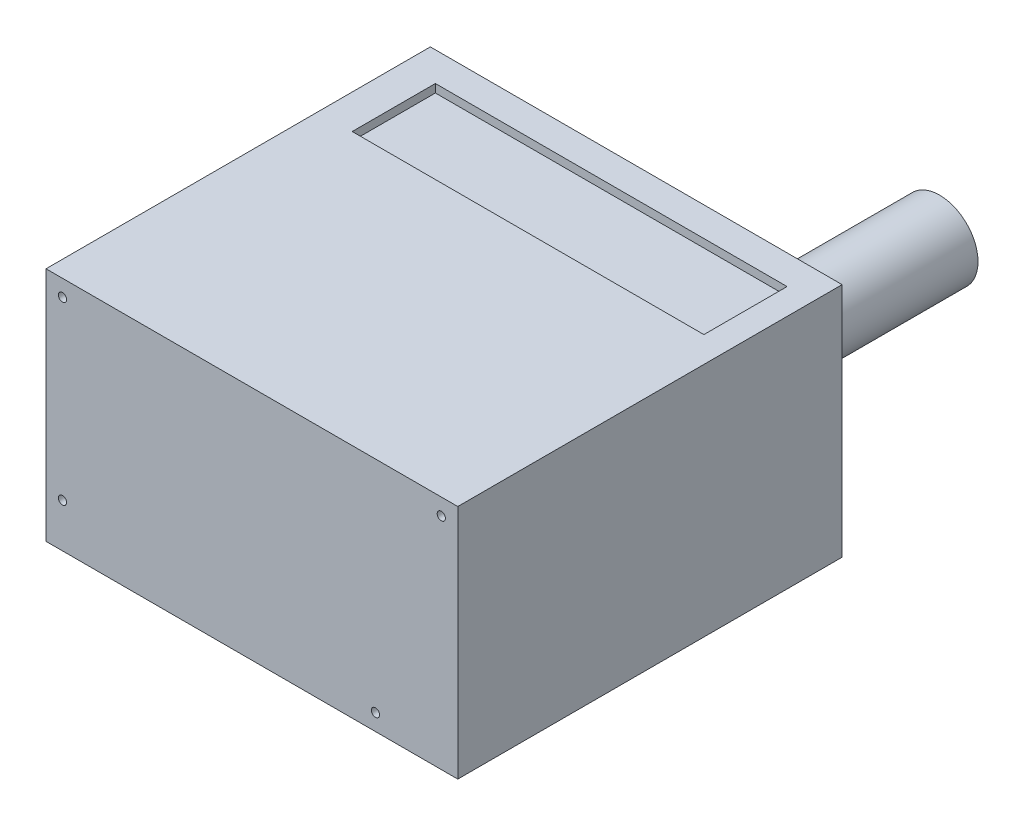
ISO-10303-21;
HEADER;
FILE_DESCRIPTION(('STEP AP214'),'2;1');
FILE_NAME('part.step','',(''),(''),'','','');
FILE_SCHEMA(('AUTOMOTIVE_DESIGN { 1 0 10303 214 1 1 1 1 }'));
ENDSEC;
DATA;
#1=APPLICATION_CONTEXT('core data for automotive mechanical design processes');
#2=APPLICATION_PROTOCOL_DEFINITION('international standard','automotive_design',2000,#1);
#3=PRODUCT_CONTEXT('',#1,'mechanical');
#4=PRODUCT('Part','Part','',(#3));
#5=PRODUCT_RELATED_PRODUCT_CATEGORY('part','',(#4));
#6=PRODUCT_DEFINITION_FORMATION('','',#4);
#7=PRODUCT_DEFINITION_CONTEXT('part definition',#1,'design');
#8=PRODUCT_DEFINITION('design','',#6,#7);
#9=PRODUCT_DEFINITION_SHAPE('','',#8);
#10=(LENGTH_UNIT() NAMED_UNIT(*) SI_UNIT(.MILLI.,.METRE.));
#11=(NAMED_UNIT(*) PLANE_ANGLE_UNIT() SI_UNIT($,.RADIAN.));
#12=(NAMED_UNIT(*) SI_UNIT($,.STERADIAN.) SOLID_ANGLE_UNIT());
#13=UNCERTAINTY_MEASURE_WITH_UNIT(LENGTH_MEASURE(1.E-05),#10,'distance_accuracy_value','');
#14=(GEOMETRIC_REPRESENTATION_CONTEXT(3) GLOBAL_UNCERTAINTY_ASSIGNED_CONTEXT((#13)) GLOBAL_UNIT_ASSIGNED_CONTEXT((#10,
#11,#12)) REPRESENTATION_CONTEXT('',''));
#15=CARTESIAN_POINT('',(0.,0.,0.));
#16=DIRECTION('',(0.,0.,1.));
#17=DIRECTION('',(1.,0.,0.));
#18=AXIS2_PLACEMENT_3D('',#15,#16,#17);
#19=CARTESIAN_POINT('',(0.,86.,0.));
#20=DIRECTION('',(1.,0.,0.));
#21=DIRECTION('',(0.,0.,-1.));
#22=AXIS2_PLACEMENT_3D('',#19,#20,#21);
#23=PLANE('',#22);
#24=DIRECTION('',(0.,0.,1.));
#25=VECTOR('',#24,1.);
#26=CARTESIAN_POINT('',(0.,0.,0.));
#27=LINE('',#26,#25);
#28=CARTESIAN_POINT('',(0.,0.,-140.));
#29=VERTEX_POINT('',#28);
#30=CARTESIAN_POINT('',(0.,0.,0.));
#31=VERTEX_POINT('',#30);
#32=EDGE_CURVE('E265',#29,#31,#27,.T.);
#33=ORIENTED_EDGE('',*,*,#32,.T.);
#34=DIRECTION('',(0.,-1.,0.));
#35=VECTOR('',#34,1.);
#36=CARTESIAN_POINT('',(0.,86.,0.));
#37=LINE('',#36,#35);
#38=CARTESIAN_POINT('',(0.,86.,0.));
#39=VERTEX_POINT('',#38);
#40=EDGE_CURVE('E59',#39,#31,#37,.T.);
#41=ORIENTED_EDGE('',*,*,#40,.F.);
#42=DIRECTION('',(0.,0.,1.));
#43=VECTOR('',#42,1.);
#44=CARTESIAN_POINT('',(0.,86.,0.));
#45=LINE('',#44,#43);
#46=CARTESIAN_POINT('',(0.,86.,-140.));
#47=VERTEX_POINT('',#46);
#48=EDGE_CURVE('E269',#47,#39,#45,.T.);
#49=ORIENTED_EDGE('',*,*,#48,.F.);
#50=DIRECTION('',(0.,-1.,0.));
#51=VECTOR('',#50,1.);
#52=CARTESIAN_POINT('',(0.,86.,-140.));
#53=LINE('',#52,#51);
#54=EDGE_CURVE('E283',#47,#29,#53,.T.);
#55=ORIENTED_EDGE('',*,*,#54,.T.);
#56=EDGE_LOOP('',(#33,#41,#49,#55));
#57=FACE_BOUND('',#56,.T.);
#58=ADVANCED_FACE('F51',(#57),#23,.F.);
#59=CARTESIAN_POINT('',(0.,86.,0.));
#60=DIRECTION('',(0.,0.,-1.));
#61=DIRECTION('',(-1.,0.,0.));
#62=AXIS2_PLACEMENT_3D('',#59,#60,#61);
#63=PLANE('',#62);
#64=CARTESIAN_POINT('',(144.,80.,0.));
#65=DIRECTION('',(0.,0.,1.));
#66=DIRECTION('',(1.,0.,0.));
#67=AXIS2_PLACEMENT_3D('',#64,#65,#66);
#68=CIRCLE('',#67,1.5);
#69=CARTESIAN_POINT('',(145.5,80.,0.));
#70=VERTEX_POINT('',#69);
#71=EDGE_CURVE('E254',#70,#70,#68,.T.);
#72=ORIENTED_EDGE('',*,*,#71,.F.);
#73=EDGE_LOOP('',(#72));
#74=FACE_BOUND('',#73,.T.);
#75=CARTESIAN_POINT('',(120.,6.,0.));
#76=DIRECTION('',(0.,0.,1.));
#77=DIRECTION('',(1.,0.,0.));
#78=AXIS2_PLACEMENT_3D('',#75,#76,#77);
#79=CIRCLE('',#78,1.5);
#80=CARTESIAN_POINT('',(121.5,6.,0.));
#81=VERTEX_POINT('',#80);
#82=EDGE_CURVE('E246',#81,#81,#79,.T.);
#83=ORIENTED_EDGE('',*,*,#82,.F.);
#84=EDGE_LOOP('',(#83));
#85=FACE_BOUND('',#84,.T.);
#86=CARTESIAN_POINT('',(6.,16.,0.));
#87=DIRECTION('',(0.,0.,1.));
#88=DIRECTION('',(1.,0.,0.));
#89=AXIS2_PLACEMENT_3D('',#86,#87,#88);
#90=CIRCLE('',#89,1.5);
#91=CARTESIAN_POINT('',(7.5,16.,0.));
#92=VERTEX_POINT('',#91);
#93=EDGE_CURVE('E237',#92,#92,#90,.T.);
#94=ORIENTED_EDGE('',*,*,#93,.F.);
#95=EDGE_LOOP('',(#94));
#96=FACE_BOUND('',#95,.T.);
#97=CARTESIAN_POINT('',(6.,80.,0.));
#98=DIRECTION('',(0.,0.,1.));
#99=DIRECTION('',(1.,0.,0.));
#100=AXIS2_PLACEMENT_3D('',#97,#98,#99);
#101=CIRCLE('',#100,1.5);
#102=CARTESIAN_POINT('',(7.5,80.,0.));
#103=VERTEX_POINT('',#102);
#104=EDGE_CURVE('E241',#103,#103,#101,.T.);
#105=ORIENTED_EDGE('',*,*,#104,.F.);
#106=EDGE_LOOP('',(#105));
#107=FACE_BOUND('',#106,.T.);
#108=DIRECTION('',(1.,0.,0.));
#109=VECTOR('',#108,1.);
#110=CARTESIAN_POINT('',(0.,0.,0.));
#111=LINE('',#110,#109);
#112=CARTESIAN_POINT('',(150.,0.,0.));
#113=VERTEX_POINT('',#112);
#114=EDGE_CURVE('E287',#31,#113,#111,.T.);
#115=ORIENTED_EDGE('',*,*,#114,.T.);
#116=DIRECTION('',(0.,-1.,0.));
#117=VECTOR('',#116,1.);
#118=CARTESIAN_POINT('',(150.,86.,0.));
#119=LINE('',#118,#117);
#120=CARTESIAN_POINT('',(150.,86.,0.));
#121=VERTEX_POINT('',#120);
#122=EDGE_CURVE('E302',#121,#113,#119,.T.);
#123=ORIENTED_EDGE('',*,*,#122,.F.);
#124=DIRECTION('',(1.,0.,0.));
#125=VECTOR('',#124,1.);
#126=CARTESIAN_POINT('',(0.,86.,0.));
#127=LINE('',#126,#125);
#128=EDGE_CURVE('E273',#39,#121,#127,.T.);
#129=ORIENTED_EDGE('',*,*,#128,.F.);
#130=ORIENTED_EDGE('',*,*,#40,.T.);
#131=EDGE_LOOP('',(#115,#123,#129,#130));
#132=FACE_BOUND('',#131,.T.);
#133=ADVANCED_FACE('F309',(#74,#85,#96,#107,#132),#63,.F.);
#134=CARTESIAN_POINT('',(150.,86.,0.));
#135=DIRECTION('',(-1.,0.,0.));
#136=DIRECTION('',(0.,0.,1.));
#137=AXIS2_PLACEMENT_3D('',#134,#135,#136);
#138=PLANE('',#137);
#139=DIRECTION('',(0.,0.,-1.));
#140=VECTOR('',#139,1.);
#141=CARTESIAN_POINT('',(150.,0.,0.));
#142=LINE('',#141,#140);
#143=CARTESIAN_POINT('',(150.,0.,-140.));
#144=VERTEX_POINT('',#143);
#145=EDGE_CURVE('E290',#113,#144,#142,.T.);
#146=ORIENTED_EDGE('',*,*,#145,.T.);
#147=DIRECTION('',(0.,-1.,0.));
#148=VECTOR('',#147,1.);
#149=CARTESIAN_POINT('',(150.,86.,-140.));
#150=LINE('',#149,#148);
#151=CARTESIAN_POINT('',(150.,86.,-140.));
#152=VERTEX_POINT('',#151);
#153=EDGE_CURVE('E298',#152,#144,#150,.T.);
#154=ORIENTED_EDGE('',*,*,#153,.F.);
#155=DIRECTION('',(0.,0.,-1.));
#156=VECTOR('',#155,1.);
#157=CARTESIAN_POINT('',(150.,86.,0.));
#158=LINE('',#157,#156);
#159=EDGE_CURVE('E277',#121,#152,#158,.T.);
#160=ORIENTED_EDGE('',*,*,#159,.F.);
#161=ORIENTED_EDGE('',*,*,#122,.T.);
#162=EDGE_LOOP('',(#146,#154,#160,#161));
#163=FACE_BOUND('',#162,.T.);
#164=ADVANCED_FACE('F321',(#163),#138,.F.);
#165=CARTESIAN_POINT('',(0.,86.,-140.));
#166=DIRECTION('',(0.,0.,1.));
#167=DIRECTION('',(1.,0.,0.));
#168=AXIS2_PLACEMENT_3D('',#165,#166,#167);
#169=PLANE('',#168);
#170=DIRECTION('',(1.,0.,0.));
#171=VECTOR('',#170,1.);
#172=CARTESIAN_POINT('',(15.74974103616,77.9100774654822,-140.));
#173=LINE('',#172,#171);
#174=CARTESIAN_POINT('',(15.74974103616,77.9100774654822,-140.));
#175=VERTEX_POINT('',#174);
#176=CARTESIAN_POINT('',(114.609488339326,77.9100774654822,-140.));
#177=VERTEX_POINT('',#176);
#178=EDGE_CURVE('E176',#175,#177,#173,.T.);
#179=ORIENTED_EDGE('',*,*,#178,.F.);
#180=DIRECTION('',(0.,1.,0.));
#181=VECTOR('',#180,1.);
#182=CARTESIAN_POINT('',(15.74974103616,77.9100774654822,-140.));
#183=LINE('',#182,#181);
#184=CARTESIAN_POINT('',(15.74974103616,5.90029547932147,-140.));
#185=VERTEX_POINT('',#184);
#186=EDGE_CURVE('E66',#185,#175,#183,.T.);
#187=ORIENTED_EDGE('',*,*,#186,.F.);
#188=DIRECTION('',(-1.,0.,0.));
#189=VECTOR('',#188,1.);
#190=CARTESIAN_POINT('',(15.74974103616,5.90029547932147,-140.));
#191=LINE('',#190,#189);
#192=CARTESIAN_POINT('',(114.609488339326,5.90029547932147,-140.));
#193=VERTEX_POINT('',#192);
#194=EDGE_CURVE('E163',#193,#185,#191,.T.);
#195=ORIENTED_EDGE('',*,*,#194,.F.);
#196=DIRECTION('',(0.,-1.,0.));
#197=VECTOR('',#196,1.);
#198=CARTESIAN_POINT('',(114.609488339326,77.9100774654822,-140.));
#199=LINE('',#198,#197);
#200=EDGE_CURVE('E167',#177,#193,#199,.T.);
#201=ORIENTED_EDGE('',*,*,#200,.F.);
#202=EDGE_LOOP('',(#179,#187,#195,#201));
#203=FACE_BOUND('',#202,.T.);
#204=CARTESIAN_POINT('',(133.5,66.,-140.));
#205=DIRECTION('',(0.,0.,1.));
#206=DIRECTION('',(1.,0.,0.));
#207=AXIS2_PLACEMENT_3D('',#204,#205,#206);
#208=CIRCLE('',#207,14.);
#209=CARTESIAN_POINT('',(147.5,66.,-140.));
#210=VERTEX_POINT('',#209);
#211=EDGE_CURVE('E11',#210,#210,#208,.F.);
#212=ORIENTED_EDGE('',*,*,#211,.F.);
#213=EDGE_LOOP('',(#212));
#214=FACE_BOUND('',#213,.T.);
#215=DIRECTION('',(-1.,0.,0.));
#216=VECTOR('',#215,1.);
#217=CARTESIAN_POINT('',(0.,0.,-140.));
#218=LINE('',#217,#216);
#219=EDGE_CURVE('E274',#144,#29,#218,.T.);
#220=ORIENTED_EDGE('',*,*,#219,.T.);
#221=ORIENTED_EDGE('',*,*,#54,.F.);
#222=DIRECTION('',(-1.,0.,0.));
#223=VECTOR('',#222,1.);
#224=CARTESIAN_POINT('',(0.,86.,-140.));
#225=LINE('',#224,#223);
#226=EDGE_CURVE('E280',#152,#47,#225,.T.);
#227=ORIENTED_EDGE('',*,*,#226,.F.);
#228=ORIENTED_EDGE('',*,*,#153,.T.);
#229=EDGE_LOOP('',(#220,#221,#227,#228));
#230=FACE_BOUND('',#229,.T.);
#231=ADVANCED_FACE('F325',(#203,#214,#230),#169,.F.);
#232=CARTESIAN_POINT('',(0.,86.,0.));
#233=DIRECTION('',(0.,-1.,0.));
#234=DIRECTION('',(0.,0.,-1.));
#235=AXIS2_PLACEMENT_3D('',#232,#233,#234);
#236=PLANE('',#235);
#237=DIRECTION('',(1.,0.,0.));
#238=VECTOR('',#237,1.);
#239=CARTESIAN_POINT('',(12.4736522115443,86.,-99.0671024841363));
#240=LINE('',#239,#238);
#241=CARTESIAN_POINT('',(12.4736522115443,86.,-99.0671024841363));
#242=VERTEX_POINT('',#241);
#243=CARTESIAN_POINT('',(140.586042786786,86.,-99.0671024841363));
#244=VERTEX_POINT('',#243);
#245=EDGE_CURVE('E214',#242,#244,#240,.T.);
#246=ORIENTED_EDGE('',*,*,#245,.F.);
#247=DIRECTION('',(0.,0.,1.));
#248=VECTOR('',#247,1.);
#249=CARTESIAN_POINT('',(12.4736522115443,86.,-129.36795295147));
#250=LINE('',#249,#248);
#251=CARTESIAN_POINT('',(12.4736522115443,86.,-129.36795295147));
#252=VERTEX_POINT('',#251);
#253=EDGE_CURVE('E74',#252,#242,#250,.T.);
#254=ORIENTED_EDGE('',*,*,#253,.F.);
#255=DIRECTION('',(-1.,0.,0.));
#256=VECTOR('',#255,1.);
#257=CARTESIAN_POINT('',(12.4736522115443,86.,-129.36795295147));
#258=LINE('',#257,#256);
#259=CARTESIAN_POINT('',(140.586042786786,86.,-129.36795295147));
#260=VERTEX_POINT('',#259);
#261=EDGE_CURVE('E199',#260,#252,#258,.T.);
#262=ORIENTED_EDGE('',*,*,#261,.F.);
#263=DIRECTION('',(0.,0.,-1.));
#264=VECTOR('',#263,1.);
#265=CARTESIAN_POINT('',(140.586042786786,86.,-129.36795295147));
#266=LINE('',#265,#264);
#267=EDGE_CURVE('E218',#244,#260,#266,.T.);
#268=ORIENTED_EDGE('',*,*,#267,.F.);
#269=EDGE_LOOP('',(#246,#254,#262,#268));
#270=FACE_BOUND('',#269,.T.);
#271=ORIENTED_EDGE('',*,*,#48,.T.);
#272=ORIENTED_EDGE('',*,*,#128,.T.);
#273=ORIENTED_EDGE('',*,*,#159,.T.);
#274=ORIENTED_EDGE('',*,*,#226,.T.);
#275=EDGE_LOOP('',(#271,#272,#273,#274));
#276=FACE_BOUND('',#275,.T.);
#277=ADVANCED_FACE('F327',(#270,#276),#236,.F.);
#278=CARTESIAN_POINT('',(0.,0.,0.));
#279=DIRECTION('',(0.,-1.,0.));
#280=DIRECTION('',(0.,0.,-1.));
#281=AXIS2_PLACEMENT_3D('',#278,#279,#280);
#282=PLANE('',#281);
#283=ORIENTED_EDGE('',*,*,#32,.F.);
#284=ORIENTED_EDGE('',*,*,#219,.F.);
#285=ORIENTED_EDGE('',*,*,#145,.F.);
#286=ORIENTED_EDGE('',*,*,#114,.F.);
#287=EDGE_LOOP('',(#283,#284,#285,#286));
#288=FACE_BOUND('',#287,.T.);
#289=ADVANCED_FACE('F317',(#288),#282,.T.);
#290=CARTESIAN_POINT('',(6.,80.,-2.99999999999994));
#291=DIRECTION('',(0.,0.,1.));
#292=DIRECTION('',(1.,0.,0.));
#293=AXIS2_PLACEMENT_3D('',#290,#291,#292);
#294=CYLINDRICAL_SURFACE('',#293,1.5);
#295=CARTESIAN_POINT('',(6.,80.,-2.99999999999994));
#296=DIRECTION('',(0.,0.,1.));
#297=DIRECTION('',(1.,0.,0.));
#298=AXIS2_PLACEMENT_3D('',#295,#296,#297);
#299=CIRCLE('',#298,1.5);
#300=CARTESIAN_POINT('',(7.5,80.,-2.99999999999994));
#301=VERTEX_POINT('',#300);
#302=EDGE_CURVE('E261',#301,#301,#299,.T.);
#303=ORIENTED_EDGE('',*,*,#302,.F.);
#304=EDGE_LOOP('',(#303));
#305=FACE_BOUND('',#304,.T.);
#306=ORIENTED_EDGE('',*,*,#104,.T.);
#307=EDGE_LOOP('',(#306));
#308=FACE_BOUND('',#307,.T.);
#309=ADVANCED_FACE('F335',(#305,#308),#294,.F.);
#310=CARTESIAN_POINT('',(6.,80.,-2.99999999999994));
#311=DIRECTION('',(0.,0.,1.));
#312=DIRECTION('',(1.,0.,0.));
#313=AXIS2_PLACEMENT_3D('',#310,#311,#312);
#314=PLANE('',#313);
#315=ORIENTED_EDGE('',*,*,#302,.T.);
#316=EDGE_LOOP('',(#315));
#317=FACE_BOUND('',#316,.T.);
#318=ADVANCED_FACE('F359',(#317),#314,.T.);
#319=CARTESIAN_POINT('',(6.,16.,-2.99999999999994));
#320=DIRECTION('',(0.,0.,1.));
#321=DIRECTION('',(1.,0.,0.));
#322=AXIS2_PLACEMENT_3D('',#319,#320,#321);
#323=CYLINDRICAL_SURFACE('',#322,1.5);
#324=CARTESIAN_POINT('',(6.,16.,-2.99999999999994));
#325=DIRECTION('',(0.,0.,1.));
#326=DIRECTION('',(1.,0.,0.));
#327=AXIS2_PLACEMENT_3D('',#324,#325,#326);
#328=CIRCLE('',#327,1.5);
#329=CARTESIAN_POINT('',(7.5,16.,-2.99999999999994));
#330=VERTEX_POINT('',#329);
#331=EDGE_CURVE('E242',#330,#330,#328,.T.);
#332=ORIENTED_EDGE('',*,*,#331,.F.);
#333=EDGE_LOOP('',(#332));
#334=FACE_BOUND('',#333,.T.);
#335=ORIENTED_EDGE('',*,*,#93,.T.);
#336=EDGE_LOOP('',(#335));
#337=FACE_BOUND('',#336,.T.);
#338=ADVANCED_FACE('F365',(#334,#337),#323,.F.);
#339=CARTESIAN_POINT('',(6.,16.,-2.99999999999994));
#340=DIRECTION('',(0.,0.,1.));
#341=DIRECTION('',(1.,0.,0.));
#342=AXIS2_PLACEMENT_3D('',#339,#340,#341);
#343=PLANE('',#342);
#344=ORIENTED_EDGE('',*,*,#331,.T.);
#345=EDGE_LOOP('',(#344));
#346=FACE_BOUND('',#345,.T.);
#347=ADVANCED_FACE('F386',(#346),#343,.T.);
#348=CARTESIAN_POINT('',(120.,6.,-2.99999999999994));
#349=DIRECTION('',(0.,0.,1.));
#350=DIRECTION('',(1.,0.,0.));
#351=AXIS2_PLACEMENT_3D('',#348,#349,#350);
#352=CYLINDRICAL_SURFACE('',#351,1.5);
#353=CARTESIAN_POINT('',(120.,6.,-2.99999999999994));
#354=DIRECTION('',(0.,0.,1.));
#355=DIRECTION('',(1.,0.,0.));
#356=AXIS2_PLACEMENT_3D('',#353,#354,#355);
#357=CIRCLE('',#356,1.5);
#358=CARTESIAN_POINT('',(121.5,6.,-2.99999999999994));
#359=VERTEX_POINT('',#358);
#360=EDGE_CURVE('E250',#359,#359,#357,.T.);
#361=ORIENTED_EDGE('',*,*,#360,.F.);
#362=EDGE_LOOP('',(#361));
#363=FACE_BOUND('',#362,.T.);
#364=ORIENTED_EDGE('',*,*,#82,.T.);
#365=EDGE_LOOP('',(#364));
#366=FACE_BOUND('',#365,.T.);
#367=ADVANCED_FACE('F382',(#363,#366),#352,.F.);
#368=CARTESIAN_POINT('',(120.,6.,-2.99999999999994));
#369=DIRECTION('',(0.,0.,1.));
#370=DIRECTION('',(1.,0.,0.));
#371=AXIS2_PLACEMENT_3D('',#368,#369,#370);
#372=PLANE('',#371);
#373=ORIENTED_EDGE('',*,*,#360,.T.);
#374=EDGE_LOOP('',(#373));
#375=FACE_BOUND('',#374,.T.);
#376=ADVANCED_FACE('F378',(#375),#372,.T.);
#377=CARTESIAN_POINT('',(144.,80.,-2.99999999999994));
#378=DIRECTION('',(0.,0.,1.));
#379=DIRECTION('',(1.,0.,0.));
#380=AXIS2_PLACEMENT_3D('',#377,#378,#379);
#381=CYLINDRICAL_SURFACE('',#380,1.5);
#382=CARTESIAN_POINT('',(144.,80.,-2.99999999999994));
#383=DIRECTION('',(0.,0.,1.));
#384=DIRECTION('',(1.,0.,0.));
#385=AXIS2_PLACEMENT_3D('',#382,#383,#384);
#386=CIRCLE('',#385,1.5);
#387=CARTESIAN_POINT('',(145.5,80.,-2.99999999999994));
#388=VERTEX_POINT('',#387);
#389=EDGE_CURVE('E228',#388,#388,#386,.T.);
#390=ORIENTED_EDGE('',*,*,#389,.F.);
#391=EDGE_LOOP('',(#390));
#392=FACE_BOUND('',#391,.T.);
#393=ORIENTED_EDGE('',*,*,#71,.T.);
#394=EDGE_LOOP('',(#393));
#395=FACE_BOUND('',#394,.T.);
#396=ADVANCED_FACE('F374',(#392,#395),#381,.F.);
#397=CARTESIAN_POINT('',(144.,80.,-2.99999999999994));
#398=DIRECTION('',(0.,0.,1.));
#399=DIRECTION('',(1.,0.,0.));
#400=AXIS2_PLACEMENT_3D('',#397,#398,#399);
#401=PLANE('',#400);
#402=ORIENTED_EDGE('',*,*,#389,.T.);
#403=EDGE_LOOP('',(#402));
#404=FACE_BOUND('',#403,.T.);
#405=ADVANCED_FACE('F370',(#404),#401,.T.);
#406=CARTESIAN_POINT('',(12.4736522115443,83.,-129.36795295147));
#407=DIRECTION('',(-1.,0.,0.));
#408=DIRECTION('',(0.,0.,1.));
#409=AXIS2_PLACEMENT_3D('',#406,#407,#408);
#410=PLANE('',#409);
#411=ORIENTED_EDGE('',*,*,#253,.T.);
#412=DIRECTION('',(0.,1.,0.));
#413=VECTOR('',#412,1.);
#414=CARTESIAN_POINT('',(12.4736522115443,83.,-99.0671024841363));
#415=LINE('',#414,#413);
#416=CARTESIAN_POINT('',(12.4736522115443,83.,-99.0671024841363));
#417=VERTEX_POINT('',#416);
#418=EDGE_CURVE('E211',#417,#242,#415,.T.);
#419=ORIENTED_EDGE('',*,*,#418,.F.);
#420=DIRECTION('',(0.,0.,1.));
#421=VECTOR('',#420,1.);
#422=CARTESIAN_POINT('',(12.4736522115443,83.,-129.36795295147));
#423=LINE('',#422,#421);
#424=CARTESIAN_POINT('',(12.4736522115443,83.,-129.36795295147));
#425=VERTEX_POINT('',#424);
#426=EDGE_CURVE('E194',#425,#417,#423,.T.);
#427=ORIENTED_EDGE('',*,*,#426,.F.);
#428=DIRECTION('',(0.,1.,0.));
#429=VECTOR('',#428,1.);
#430=CARTESIAN_POINT('',(12.4736522115443,83.,-129.36795295147));
#431=LINE('',#430,#429);
#432=EDGE_CURVE('E225',#425,#252,#431,.T.);
#433=ORIENTED_EDGE('',*,*,#432,.T.);
#434=EDGE_LOOP('',(#411,#419,#427,#433));
#435=FACE_BOUND('',#434,.T.);
#436=ADVANCED_FACE('F373',(#435),#410,.F.);
#437=CARTESIAN_POINT('',(12.4736522115443,83.,-129.36795295147));
#438=DIRECTION('',(0.,0.,-1.));
#439=DIRECTION('',(-1.,0.,0.));
#440=AXIS2_PLACEMENT_3D('',#437,#438,#439);
#441=PLANE('',#440);
#442=ORIENTED_EDGE('',*,*,#261,.T.);
#443=ORIENTED_EDGE('',*,*,#432,.F.);
#444=DIRECTION('',(-1.,0.,0.));
#445=VECTOR('',#444,1.);
#446=CARTESIAN_POINT('',(12.4736522115443,83.,-129.36795295147));
#447=LINE('',#446,#445);
#448=CARTESIAN_POINT('',(140.586042786786,83.,-129.36795295147));
#449=VERTEX_POINT('',#448);
#450=EDGE_CURVE('E207',#449,#425,#447,.T.);
#451=ORIENTED_EDGE('',*,*,#450,.F.);
#452=DIRECTION('',(0.,1.,0.));
#453=VECTOR('',#452,1.);
#454=CARTESIAN_POINT('',(140.586042786786,83.,-129.36795295147));
#455=LINE('',#454,#453);
#456=EDGE_CURVE('E229',#449,#260,#455,.T.);
#457=ORIENTED_EDGE('',*,*,#456,.T.);
#458=EDGE_LOOP('',(#442,#443,#451,#457));
#459=FACE_BOUND('',#458,.T.);
#460=ADVANCED_FACE('F396',(#459),#441,.F.);
#461=CARTESIAN_POINT('',(140.586042786786,83.,-129.36795295147));
#462=DIRECTION('',(1.,0.,0.));
#463=DIRECTION('',(0.,0.,-1.));
#464=AXIS2_PLACEMENT_3D('',#461,#462,#463);
#465=PLANE('',#464);
#466=ORIENTED_EDGE('',*,*,#267,.T.);
#467=ORIENTED_EDGE('',*,*,#456,.F.);
#468=DIRECTION('',(0.,0.,-1.));
#469=VECTOR('',#468,1.);
#470=CARTESIAN_POINT('',(140.586042786786,83.,-129.36795295147));
#471=LINE('',#470,#469);
#472=CARTESIAN_POINT('',(140.586042786786,83.,-99.0671024841363));
#473=VERTEX_POINT('',#472);
#474=EDGE_CURVE('E203',#473,#449,#471,.T.);
#475=ORIENTED_EDGE('',*,*,#474,.F.);
#476=DIRECTION('',(0.,1.,0.));
#477=VECTOR('',#476,1.);
#478=CARTESIAN_POINT('',(140.586042786786,83.,-99.0671024841363));
#479=LINE('',#478,#477);
#480=EDGE_CURVE('E232',#473,#244,#479,.T.);
#481=ORIENTED_EDGE('',*,*,#480,.T.);
#482=EDGE_LOOP('',(#466,#467,#475,#481));
#483=FACE_BOUND('',#482,.T.);
#484=ADVANCED_FACE('F401',(#483),#465,.F.);
#485=CARTESIAN_POINT('',(12.4736522115443,83.,-99.0671024841363));
#486=DIRECTION('',(0.,0.,1.));
#487=DIRECTION('',(1.,0.,0.));
#488=AXIS2_PLACEMENT_3D('',#485,#486,#487);
#489=PLANE('',#488);
#490=ORIENTED_EDGE('',*,*,#245,.T.);
#491=ORIENTED_EDGE('',*,*,#480,.F.);
#492=DIRECTION('',(1.,0.,0.));
#493=VECTOR('',#492,1.);
#494=CARTESIAN_POINT('',(12.4736522115443,83.,-99.0671024841363));
#495=LINE('',#494,#493);
#496=EDGE_CURVE('E198',#417,#473,#495,.T.);
#497=ORIENTED_EDGE('',*,*,#496,.F.);
#498=ORIENTED_EDGE('',*,*,#418,.T.);
#499=EDGE_LOOP('',(#490,#491,#497,#498));
#500=FACE_BOUND('',#499,.T.);
#501=ADVANCED_FACE('F397',(#500),#489,.F.);
#502=CARTESIAN_POINT('',(0.,83.,0.));
#503=DIRECTION('',(0.,1.,0.));
#504=DIRECTION('',(0.,0.,1.));
#505=AXIS2_PLACEMENT_3D('',#502,#503,#504);
#506=PLANE('',#505);
#507=ORIENTED_EDGE('',*,*,#426,.T.);
#508=ORIENTED_EDGE('',*,*,#496,.T.);
#509=ORIENTED_EDGE('',*,*,#474,.T.);
#510=ORIENTED_EDGE('',*,*,#450,.T.);
#511=EDGE_LOOP('',(#507,#508,#509,#510));
#512=FACE_BOUND('',#511,.T.);
#513=ADVANCED_FACE('F400',(#512),#506,.T.);
#514=CARTESIAN_POINT('',(133.5,66.,-192.));
#515=DIRECTION('',(0.,0.,1.));
#516=DIRECTION('',(1.,0.,0.));
#517=AXIS2_PLACEMENT_3D('',#514,#515,#516);
#518=CYLINDRICAL_SURFACE('',#517,14.);
#519=CARTESIAN_POINT('',(133.5,66.,-192.));
#520=DIRECTION('',(0.,0.,-1.));
#521=DIRECTION('',(-1.,0.,0.));
#522=AXIS2_PLACEMENT_3D('',#519,#520,#521);
#523=CIRCLE('',#522,14.);
#524=CARTESIAN_POINT('',(119.5,66.,-192.));
#525=VERTEX_POINT('',#524);
#526=EDGE_CURVE('E185',#525,#525,#523,.T.);
#527=ORIENTED_EDGE('',*,*,#526,.F.);
#528=EDGE_LOOP('',(#527));
#529=FACE_BOUND('',#528,.T.);
#530=ORIENTED_EDGE('',*,*,#211,.T.);
#531=EDGE_LOOP('',(#530));
#532=FACE_BOUND('',#531,.T.);
#533=ADVANCED_FACE('F411',(#529,#532),#518,.T.);
#534=CARTESIAN_POINT('',(133.5,66.,-192.));
#535=DIRECTION('',(0.,0.,-1.));
#536=DIRECTION('',(-1.,0.,0.));
#537=AXIS2_PLACEMENT_3D('',#534,#535,#536);
#538=PLANE('',#537);
#539=ORIENTED_EDGE('',*,*,#526,.T.);
#540=EDGE_LOOP('',(#539));
#541=FACE_BOUND('',#540,.T.);
#542=ADVANCED_FACE('F415',(#541),#538,.T.);
#543=CARTESIAN_POINT('',(15.74974103616,77.9100774654822,-137.));
#544=DIRECTION('',(-1.,0.,0.));
#545=DIRECTION('',(0.,0.,1.));
#546=AXIS2_PLACEMENT_3D('',#543,#544,#545);
#547=PLANE('',#546);
#548=ORIENTED_EDGE('',*,*,#186,.T.);
#549=DIRECTION('',(0.,0.,-1.));
#550=VECTOR('',#549,1.);
#551=CARTESIAN_POINT('',(15.74974103616,77.9100774654822,-137.));
#552=LINE('',#551,#550);
#553=CARTESIAN_POINT('',(15.74974103616,77.9100774654822,-137.));
#554=VERTEX_POINT('',#553);
#555=EDGE_CURVE('E138',#554,#175,#552,.T.);
#556=ORIENTED_EDGE('',*,*,#555,.F.);
#557=DIRECTION('',(0.,1.,0.));
#558=VECTOR('',#557,1.);
#559=CARTESIAN_POINT('',(15.74974103616,77.9100774654822,-137.));
#560=LINE('',#559,#558);
#561=CARTESIAN_POINT('',(15.74974103616,5.90029547932147,-137.));
#562=VERTEX_POINT('',#561);
#563=EDGE_CURVE('E142',#562,#554,#560,.T.);
#564=ORIENTED_EDGE('',*,*,#563,.F.);
#565=DIRECTION('',(0.,0.,-1.));
#566=VECTOR('',#565,1.);
#567=CARTESIAN_POINT('',(15.74974103616,5.90029547932147,-137.));
#568=LINE('',#567,#566);
#569=EDGE_CURVE('E182',#562,#185,#568,.T.);
#570=ORIENTED_EDGE('',*,*,#569,.T.);
#571=EDGE_LOOP('',(#548,#556,#564,#570));
#572=FACE_BOUND('',#571,.T.);
#573=ADVANCED_FACE('F140',(#572),#547,.F.);
#574=CARTESIAN_POINT('',(15.74974103616,5.90029547932147,-137.));
#575=DIRECTION('',(0.,-1.,0.));
#576=DIRECTION('',(0.,0.,-1.));
#577=AXIS2_PLACEMENT_3D('',#574,#575,#576);
#578=PLANE('',#577);
#579=ORIENTED_EDGE('',*,*,#194,.T.);
#580=ORIENTED_EDGE('',*,*,#569,.F.);
#581=DIRECTION('',(-1.,0.,0.));
#582=VECTOR('',#581,1.);
#583=CARTESIAN_POINT('',(15.74974103616,5.90029547932147,-137.));
#584=LINE('',#583,#582);
#585=CARTESIAN_POINT('',(114.609488339326,5.90029547932147,-137.));
#586=VERTEX_POINT('',#585);
#587=EDGE_CURVE('E149',#586,#562,#584,.T.);
#588=ORIENTED_EDGE('',*,*,#587,.F.);
#589=DIRECTION('',(0.,0.,-1.));
#590=VECTOR('',#589,1.);
#591=CARTESIAN_POINT('',(114.609488339326,5.90029547932147,-137.));
#592=LINE('',#591,#590);
#593=EDGE_CURVE('E186',#586,#193,#592,.T.);
#594=ORIENTED_EDGE('',*,*,#593,.T.);
#595=EDGE_LOOP('',(#579,#580,#588,#594));
#596=FACE_BOUND('',#595,.T.);
#597=ADVANCED_FACE('F422',(#596),#578,.F.);
#598=CARTESIAN_POINT('',(114.609488339326,77.9100774654822,-137.));
#599=DIRECTION('',(1.,0.,0.));
#600=DIRECTION('',(0.,0.,-1.));
#601=AXIS2_PLACEMENT_3D('',#598,#599,#600);
#602=PLANE('',#601);
#603=ORIENTED_EDGE('',*,*,#200,.T.);
#604=ORIENTED_EDGE('',*,*,#593,.F.);
#605=DIRECTION('',(0.,-1.,0.));
#606=VECTOR('',#605,1.);
#607=CARTESIAN_POINT('',(114.609488339326,77.9100774654822,-137.));
#608=LINE('',#607,#606);
#609=CARTESIAN_POINT('',(114.609488339326,77.9100774654822,-137.));
#610=VERTEX_POINT('',#609);
#611=EDGE_CURVE('E158',#610,#586,#608,.T.);
#612=ORIENTED_EDGE('',*,*,#611,.F.);
#613=DIRECTION('',(0.,0.,-1.));
#614=VECTOR('',#613,1.);
#615=CARTESIAN_POINT('',(114.609488339326,77.9100774654822,-137.));
#616=LINE('',#615,#614);
#617=EDGE_CURVE('E148',#610,#177,#616,.T.);
#618=ORIENTED_EDGE('',*,*,#617,.T.);
#619=EDGE_LOOP('',(#603,#604,#612,#618));
#620=FACE_BOUND('',#619,.T.);
#621=ADVANCED_FACE('F425',(#620),#602,.F.);
#622=CARTESIAN_POINT('',(15.74974103616,77.9100774654822,-137.));
#623=DIRECTION('',(0.,1.,0.));
#624=DIRECTION('',(0.,0.,1.));
#625=AXIS2_PLACEMENT_3D('',#622,#623,#624);
#626=PLANE('',#625);
#627=ORIENTED_EDGE('',*,*,#178,.T.);
#628=ORIENTED_EDGE('',*,*,#617,.F.);
#629=DIRECTION('',(1.,0.,0.));
#630=VECTOR('',#629,1.);
#631=CARTESIAN_POINT('',(15.74974103616,77.9100774654822,-137.));
#632=LINE('',#631,#630);
#633=EDGE_CURVE('E152',#554,#610,#632,.T.);
#634=ORIENTED_EDGE('',*,*,#633,.F.);
#635=ORIENTED_EDGE('',*,*,#555,.T.);
#636=EDGE_LOOP('',(#627,#628,#634,#635));
#637=FACE_BOUND('',#636,.T.);
#638=ADVANCED_FACE('F153',(#637),#626,.F.);
#639=CARTESIAN_POINT('',(0.,0.,-137.));
#640=DIRECTION('',(0.,0.,1.));
#641=DIRECTION('',(1.,0.,0.));
#642=AXIS2_PLACEMENT_3D('',#639,#640,#641);
#643=PLANE('',#642);
#644=ORIENTED_EDGE('',*,*,#563,.T.);
#645=ORIENTED_EDGE('',*,*,#633,.T.);
#646=ORIENTED_EDGE('',*,*,#611,.T.);
#647=ORIENTED_EDGE('',*,*,#587,.T.);
#648=EDGE_LOOP('',(#644,#645,#646,#647));
#649=FACE_BOUND('',#648,.T.);
#650=ADVANCED_FACE('F160',(#649),#643,.F.);
#651=CLOSED_SHELL('',(#58,#133,#164,#231,#277,#289,#309,#318,#338,#347,#367,#376,#396,#405,#436,
#460,#484,#501,#513,#533,#542,#573,#597,#621,#638,#650));
#652=MANIFOLD_SOLID_BREP('B2',#651);
#653=ADVANCED_BREP_SHAPE_REPRESENTATION('',(#18,#652),#14);
#654=SHAPE_DEFINITION_REPRESENTATION(#9,#653);
ENDSEC;
END-ISO-10303-21;
